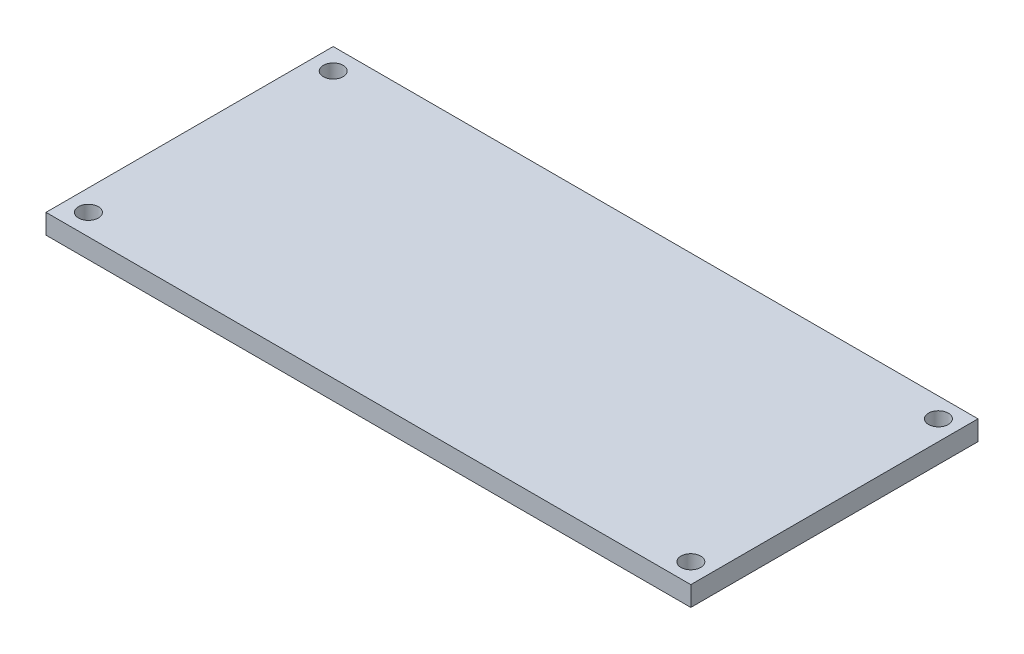
ISO-10303-21;
HEADER;
FILE_DESCRIPTION(('STEP AP214'),'2;1');
FILE_NAME('part.step','',(''),(''),'','','');
FILE_SCHEMA(('AUTOMOTIVE_DESIGN { 1 0 10303 214 1 1 1 1 }'));
ENDSEC;
DATA;
#1=APPLICATION_CONTEXT('core data for automotive mechanical design processes');
#2=APPLICATION_PROTOCOL_DEFINITION('international standard','automotive_design',2000,#1);
#3=PRODUCT_CONTEXT('',#1,'mechanical');
#4=PRODUCT('Part','Part','',(#3));
#5=PRODUCT_RELATED_PRODUCT_CATEGORY('part','',(#4));
#6=PRODUCT_DEFINITION_FORMATION('','',#4);
#7=PRODUCT_DEFINITION_CONTEXT('part definition',#1,'design');
#8=PRODUCT_DEFINITION('design','',#6,#7);
#9=PRODUCT_DEFINITION_SHAPE('','',#8);
#10=(LENGTH_UNIT() NAMED_UNIT(*) SI_UNIT(.MILLI.,.METRE.));
#11=(NAMED_UNIT(*) PLANE_ANGLE_UNIT() SI_UNIT($,.RADIAN.));
#12=(NAMED_UNIT(*) SI_UNIT($,.STERADIAN.) SOLID_ANGLE_UNIT());
#13=UNCERTAINTY_MEASURE_WITH_UNIT(LENGTH_MEASURE(1.E-05),#10,'distance_accuracy_value','');
#14=(GEOMETRIC_REPRESENTATION_CONTEXT(3) GLOBAL_UNCERTAINTY_ASSIGNED_CONTEXT((#13)) GLOBAL_UNIT_ASSIGNED_CONTEXT((#10,
#11,#12)) REPRESENTATION_CONTEXT('',''));
#15=CARTESIAN_POINT('',(0.,0.,0.));
#16=DIRECTION('',(0.,0.,1.));
#17=DIRECTION('',(1.,0.,0.));
#18=AXIS2_PLACEMENT_3D('',#15,#16,#17);
#19=CARTESIAN_POINT('',(0.,1.4,0.));
#20=DIRECTION('',(0.,1.,0.));
#21=DIRECTION('',(0.,0.,1.));
#22=AXIS2_PLACEMENT_3D('',#19,#20,#21);
#23=PLANE('',#22);
#24=CARTESIAN_POINT('',(21.5392406689904,1.4,-10.7624203821656));
#25=DIRECTION('',(0.,1.,0.));
#26=DIRECTION('',(0.,0.,1.));
#27=AXIS2_PLACEMENT_3D('',#24,#25,#26);
#28=CIRCLE('',#27,0.699999999999998);
#29=CARTESIAN_POINT('',(21.5392406689904,1.4,-10.0624203821656));
#30=VERTEX_POINT('',#29);
#31=EDGE_CURVE('E123',#30,#30,#28,.T.);
#32=ORIENTED_EDGE('',*,*,#31,.F.);
#33=EDGE_LOOP('',(#32));
#34=FACE_BOUND('',#33,.T.);
#35=CARTESIAN_POINT('',(-21.1607593310096,1.4,-10.6624203821656));
#36=DIRECTION('',(0.,1.,0.));
#37=DIRECTION('',(0.,0.,1.));
#38=AXIS2_PLACEMENT_3D('',#35,#36,#37);
#39=CIRCLE('',#38,0.699999999999998);
#40=CARTESIAN_POINT('',(-21.1607593310096,1.4,-9.96242038216561));
#41=VERTEX_POINT('',#40);
#42=EDGE_CURVE('E102',#41,#41,#39,.T.);
#43=ORIENTED_EDGE('',*,*,#42,.F.);
#44=EDGE_LOOP('',(#43));
#45=FACE_BOUND('',#44,.T.);
#46=DIRECTION('',(0.,0.,1.));
#47=VECTOR('',#46,1.);
#48=CARTESIAN_POINT('',(-22.6607593310096,1.4,-12.1624203821656));
#49=LINE('',#48,#47);
#50=CARTESIAN_POINT('',(-22.6607593310096,1.4,-12.1624203821656));
#51=VERTEX_POINT('',#50);
#52=CARTESIAN_POINT('',(-22.6607593310096,1.4,8.1475796178344));
#53=VERTEX_POINT('',#52);
#54=EDGE_CURVE('E87',#51,#53,#49,.T.);
#55=ORIENTED_EDGE('',*,*,#54,.T.);
#56=DIRECTION('',(1.,0.,0.));
#57=VECTOR('',#56,1.);
#58=CARTESIAN_POINT('',(-22.6607593310096,1.4,8.1475796178344));
#59=LINE('',#58,#57);
#60=CARTESIAN_POINT('',(22.9392406689904,1.4,8.1475796178344));
#61=VERTEX_POINT('',#60);
#62=EDGE_CURVE('E82',#53,#61,#59,.T.);
#63=ORIENTED_EDGE('',*,*,#62,.T.);
#64=DIRECTION('',(0.,0.,-1.));
#65=VECTOR('',#64,1.);
#66=CARTESIAN_POINT('',(22.9392406689904,1.4,-12.1624203821656));
#67=LINE('',#66,#65);
#68=CARTESIAN_POINT('',(22.9392406689904,1.4,-12.1624203821656));
#69=VERTEX_POINT('',#68);
#70=EDGE_CURVE('E85',#61,#69,#67,.T.);
#71=ORIENTED_EDGE('',*,*,#70,.T.);
#72=DIRECTION('',(-1.,0.,0.));
#73=VECTOR('',#72,1.);
#74=CARTESIAN_POINT('',(-22.6607593310096,1.4,-12.1624203821656));
#75=LINE('',#74,#73);
#76=EDGE_CURVE('E52',#69,#51,#75,.T.);
#77=ORIENTED_EDGE('',*,*,#76,.T.);
#78=EDGE_LOOP('',(#55,#63,#71,#77));
#79=FACE_BOUND('',#78,.T.);
#80=CARTESIAN_POINT('',(-21.1607593310096,1.4,6.6475796178344));
#81=DIRECTION('',(0.,1.,0.));
#82=DIRECTION('',(0.,0.,1.));
#83=AXIS2_PLACEMENT_3D('',#80,#81,#82);
#84=CIRCLE('',#83,0.699999999999998);
#85=CARTESIAN_POINT('',(-21.1607593310096,1.4,7.34757961783439));
#86=VERTEX_POINT('',#85);
#87=EDGE_CURVE('E117',#86,#86,#84,.T.);
#88=ORIENTED_EDGE('',*,*,#87,.F.);
#89=EDGE_LOOP('',(#88));
#90=FACE_BOUND('',#89,.T.);
#91=CARTESIAN_POINT('',(21.5392406689904,1.4,6.7475796178344));
#92=DIRECTION('',(0.,1.,0.));
#93=DIRECTION('',(0.,0.,1.));
#94=AXIS2_PLACEMENT_3D('',#91,#92,#93);
#95=CIRCLE('',#94,0.699999999999998);
#96=CARTESIAN_POINT('',(21.5392406689904,1.4,7.44757961783439));
#97=VERTEX_POINT('',#96);
#98=EDGE_CURVE('E129',#97,#97,#95,.T.);
#99=ORIENTED_EDGE('',*,*,#98,.F.);
#100=EDGE_LOOP('',(#99));
#101=FACE_BOUND('',#100,.T.);
#102=ADVANCED_FACE('F35',(#34,#45,#79,#90,#101),#23,.T.);
#103=CARTESIAN_POINT('',(0.,0.,0.));
#104=DIRECTION('',(0.,1.,0.));
#105=DIRECTION('',(0.,0.,1.));
#106=AXIS2_PLACEMENT_3D('',#103,#104,#105);
#107=PLANE('',#106);
#108=DIRECTION('',(0.,0.,1.));
#109=VECTOR('',#108,1.);
#110=CARTESIAN_POINT('',(-22.6607593310096,0.,-12.1624203821656));
#111=LINE('',#110,#109);
#112=CARTESIAN_POINT('',(-22.6607593310096,0.,-12.1624203821656));
#113=VERTEX_POINT('',#112);
#114=CARTESIAN_POINT('',(-22.6607593310096,0.,8.1475796178344));
#115=VERTEX_POINT('',#114);
#116=EDGE_CURVE('E99',#113,#115,#111,.T.);
#117=ORIENTED_EDGE('',*,*,#116,.F.);
#118=DIRECTION('',(-1.,0.,0.));
#119=VECTOR('',#118,1.);
#120=CARTESIAN_POINT('',(-22.6607593310096,0.,-12.1624203821656));
#121=LINE('',#120,#119);
#122=CARTESIAN_POINT('',(22.9392406689904,0.,-12.1624203821656));
#123=VERTEX_POINT('',#122);
#124=EDGE_CURVE('E75',#123,#113,#121,.T.);
#125=ORIENTED_EDGE('',*,*,#124,.F.);
#126=DIRECTION('',(0.,0.,-1.));
#127=VECTOR('',#126,1.);
#128=CARTESIAN_POINT('',(22.9392406689904,0.,-12.1624203821656));
#129=LINE('',#128,#127);
#130=CARTESIAN_POINT('',(22.9392406689904,0.,8.1475796178344));
#131=VERTEX_POINT('',#130);
#132=EDGE_CURVE('E69',#131,#123,#129,.T.);
#133=ORIENTED_EDGE('',*,*,#132,.F.);
#134=DIRECTION('',(1.,0.,0.));
#135=VECTOR('',#134,1.);
#136=CARTESIAN_POINT('',(-22.6607593310096,0.,8.1475796178344));
#137=LINE('',#136,#135);
#138=EDGE_CURVE('E91',#115,#131,#137,.T.);
#139=ORIENTED_EDGE('',*,*,#138,.F.);
#140=EDGE_LOOP('',(#117,#125,#133,#139));
#141=FACE_BOUND('',#140,.T.);
#142=CARTESIAN_POINT('',(-21.1607593310096,0.,-10.6624203821656));
#143=DIRECTION('',(0.,1.,0.));
#144=DIRECTION('',(0.,0.,1.));
#145=AXIS2_PLACEMENT_3D('',#142,#143,#144);
#146=CIRCLE('',#145,0.699999999999998);
#147=CARTESIAN_POINT('',(-21.1607593310096,0.,-9.96242038216561));
#148=VERTEX_POINT('',#147);
#149=EDGE_CURVE('E114',#148,#148,#146,.T.);
#150=ORIENTED_EDGE('',*,*,#149,.T.);
#151=EDGE_LOOP('',(#150));
#152=FACE_BOUND('',#151,.T.);
#153=CARTESIAN_POINT('',(-21.1607593310096,0.,6.6475796178344));
#154=DIRECTION('',(0.,1.,0.));
#155=DIRECTION('',(0.,0.,1.));
#156=AXIS2_PLACEMENT_3D('',#153,#154,#155);
#157=CIRCLE('',#156,0.699999999999998);
#158=CARTESIAN_POINT('',(-21.1607593310096,0.,7.34757961783439));
#159=VERTEX_POINT('',#158);
#160=EDGE_CURVE('E120',#159,#159,#157,.T.);
#161=ORIENTED_EDGE('',*,*,#160,.T.);
#162=EDGE_LOOP('',(#161));
#163=FACE_BOUND('',#162,.T.);
#164=CARTESIAN_POINT('',(21.5392406689904,0.,-10.7624203821656));
#165=DIRECTION('',(0.,1.,0.));
#166=DIRECTION('',(0.,0.,1.));
#167=AXIS2_PLACEMENT_3D('',#164,#165,#166);
#168=CIRCLE('',#167,0.699999999999998);
#169=CARTESIAN_POINT('',(21.5392406689904,0.,-10.0624203821656));
#170=VERTEX_POINT('',#169);
#171=EDGE_CURVE('E126',#170,#170,#168,.T.);
#172=ORIENTED_EDGE('',*,*,#171,.T.);
#173=EDGE_LOOP('',(#172));
#174=FACE_BOUND('',#173,.T.);
#175=CARTESIAN_POINT('',(21.5392406689904,0.,6.7475796178344));
#176=DIRECTION('',(0.,1.,0.));
#177=DIRECTION('',(0.,0.,1.));
#178=AXIS2_PLACEMENT_3D('',#175,#176,#177);
#179=CIRCLE('',#178,0.699999999999998);
#180=CARTESIAN_POINT('',(21.5392406689904,0.,7.44757961783439));
#181=VERTEX_POINT('',#180);
#182=EDGE_CURVE('E132',#181,#181,#179,.T.);
#183=ORIENTED_EDGE('',*,*,#182,.T.);
#184=EDGE_LOOP('',(#183));
#185=FACE_BOUND('',#184,.T.);
#186=ADVANCED_FACE('F110',(#141,#152,#163,#174,#185),#107,.F.);
#187=CARTESIAN_POINT('',(-22.6607593310096,1.4,-12.1624203821656));
#188=DIRECTION('',(1.,0.,0.));
#189=DIRECTION('',(0.,0.,-1.));
#190=AXIS2_PLACEMENT_3D('',#187,#188,#189);
#191=PLANE('',#190);
#192=ORIENTED_EDGE('',*,*,#116,.T.);
#193=DIRECTION('',(0.,-1.,0.));
#194=VECTOR('',#193,1.);
#195=CARTESIAN_POINT('',(-22.6607593310096,1.4,8.1475796178344));
#196=LINE('',#195,#194);
#197=EDGE_CURVE('E11',#53,#115,#196,.T.);
#198=ORIENTED_EDGE('',*,*,#197,.F.);
#199=ORIENTED_EDGE('',*,*,#54,.F.);
#200=DIRECTION('',(0.,-1.,0.));
#201=VECTOR('',#200,1.);
#202=CARTESIAN_POINT('',(-22.6607593310096,1.4,-12.1624203821656));
#203=LINE('',#202,#201);
#204=EDGE_CURVE('E95',#51,#113,#203,.T.);
#205=ORIENTED_EDGE('',*,*,#204,.T.);
#206=EDGE_LOOP('',(#192,#198,#199,#205));
#207=FACE_BOUND('',#206,.T.);
#208=ADVANCED_FACE('F37',(#207),#191,.F.);
#209=CARTESIAN_POINT('',(-22.6607593310096,1.4,8.1475796178344));
#210=DIRECTION('',(0.,0.,-1.));
#211=DIRECTION('',(-1.,0.,0.));
#212=AXIS2_PLACEMENT_3D('',#209,#210,#211);
#213=PLANE('',#212);
#214=ORIENTED_EDGE('',*,*,#138,.T.);
#215=DIRECTION('',(0.,-1.,0.));
#216=VECTOR('',#215,1.);
#217=CARTESIAN_POINT('',(22.9392406689904,1.4,8.1475796178344));
#218=LINE('',#217,#216);
#219=EDGE_CURVE('E44',#61,#131,#218,.T.);
#220=ORIENTED_EDGE('',*,*,#219,.F.);
#221=ORIENTED_EDGE('',*,*,#62,.F.);
#222=ORIENTED_EDGE('',*,*,#197,.T.);
#223=EDGE_LOOP('',(#214,#220,#221,#222));
#224=FACE_BOUND('',#223,.T.);
#225=ADVANCED_FACE('F90',(#224),#213,.F.);
#226=CARTESIAN_POINT('',(22.9392406689904,1.4,-12.1624203821656));
#227=DIRECTION('',(-1.,0.,0.));
#228=DIRECTION('',(0.,0.,1.));
#229=AXIS2_PLACEMENT_3D('',#226,#227,#228);
#230=PLANE('',#229);
#231=ORIENTED_EDGE('',*,*,#132,.T.);
#232=DIRECTION('',(0.,-1.,0.));
#233=VECTOR('',#232,1.);
#234=CARTESIAN_POINT('',(22.9392406689904,1.4,-12.1624203821656));
#235=LINE('',#234,#233);
#236=EDGE_CURVE('E92',#69,#123,#235,.T.);
#237=ORIENTED_EDGE('',*,*,#236,.F.);
#238=ORIENTED_EDGE('',*,*,#70,.F.);
#239=ORIENTED_EDGE('',*,*,#219,.T.);
#240=EDGE_LOOP('',(#231,#237,#238,#239));
#241=FACE_BOUND('',#240,.T.);
#242=ADVANCED_FACE('F93',(#241),#230,.F.);
#243=CARTESIAN_POINT('',(-22.6607593310096,1.4,-12.1624203821656));
#244=DIRECTION('',(0.,0.,1.));
#245=DIRECTION('',(1.,0.,0.));
#246=AXIS2_PLACEMENT_3D('',#243,#244,#245);
#247=PLANE('',#246);
#248=ORIENTED_EDGE('',*,*,#124,.T.);
#249=ORIENTED_EDGE('',*,*,#204,.F.);
#250=ORIENTED_EDGE('',*,*,#76,.F.);
#251=ORIENTED_EDGE('',*,*,#236,.T.);
#252=EDGE_LOOP('',(#248,#249,#250,#251));
#253=FACE_BOUND('',#252,.T.);
#254=ADVANCED_FACE('F107',(#253),#247,.F.);
#255=CARTESIAN_POINT('',(-21.1607593310096,1.4,-10.6624203821656));
#256=DIRECTION('',(0.,-1.,0.));
#257=DIRECTION('',(0.,0.,-1.));
#258=AXIS2_PLACEMENT_3D('',#255,#256,#257);
#259=CYLINDRICAL_SURFACE('',#258,0.699999999999998);
#260=ORIENTED_EDGE('',*,*,#42,.T.);
#261=EDGE_LOOP('',(#260));
#262=FACE_BOUND('',#261,.T.);
#263=ORIENTED_EDGE('',*,*,#149,.F.);
#264=EDGE_LOOP('',(#263));
#265=FACE_BOUND('',#264,.T.);
#266=ADVANCED_FACE('F151',(#262,#265),#259,.F.);
#267=CARTESIAN_POINT('',(-21.1607593310096,1.4,6.6475796178344));
#268=DIRECTION('',(0.,-1.,0.));
#269=DIRECTION('',(0.,0.,-1.));
#270=AXIS2_PLACEMENT_3D('',#267,#268,#269);
#271=CYLINDRICAL_SURFACE('',#270,0.699999999999998);
#272=ORIENTED_EDGE('',*,*,#87,.T.);
#273=EDGE_LOOP('',(#272));
#274=FACE_BOUND('',#273,.T.);
#275=ORIENTED_EDGE('',*,*,#160,.F.);
#276=EDGE_LOOP('',(#275));
#277=FACE_BOUND('',#276,.T.);
#278=ADVANCED_FACE('F197',(#274,#277),#271,.F.);
#279=CARTESIAN_POINT('',(21.5392406689904,1.4,-10.7624203821656));
#280=DIRECTION('',(0.,-1.,0.));
#281=DIRECTION('',(0.,0.,-1.));
#282=AXIS2_PLACEMENT_3D('',#279,#280,#281);
#283=CYLINDRICAL_SURFACE('',#282,0.699999999999998);
#284=ORIENTED_EDGE('',*,*,#31,.T.);
#285=EDGE_LOOP('',(#284));
#286=FACE_BOUND('',#285,.T.);
#287=ORIENTED_EDGE('',*,*,#171,.F.);
#288=EDGE_LOOP('',(#287));
#289=FACE_BOUND('',#288,.T.);
#290=ADVANCED_FACE('F205',(#286,#289),#283,.F.);
#291=CARTESIAN_POINT('',(21.5392406689904,1.4,6.7475796178344));
#292=DIRECTION('',(0.,-1.,0.));
#293=DIRECTION('',(0.,0.,-1.));
#294=AXIS2_PLACEMENT_3D('',#291,#292,#293);
#295=CYLINDRICAL_SURFACE('',#294,0.699999999999998);
#296=ORIENTED_EDGE('',*,*,#98,.T.);
#297=EDGE_LOOP('',(#296));
#298=FACE_BOUND('',#297,.T.);
#299=ORIENTED_EDGE('',*,*,#182,.F.);
#300=EDGE_LOOP('',(#299));
#301=FACE_BOUND('',#300,.T.);
#302=ADVANCED_FACE('F138',(#298,#301),#295,.F.);
#303=CLOSED_SHELL('',(#102,#186,#208,#225,#242,#254,#266,#278,#290,#302));
#304=MANIFOLD_SOLID_BREP('B2',#303);
#305=ADVANCED_BREP_SHAPE_REPRESENTATION('',(#18,#304),#14);
#306=SHAPE_DEFINITION_REPRESENTATION(#9,#305);
ENDSEC;
END-ISO-10303-21;
